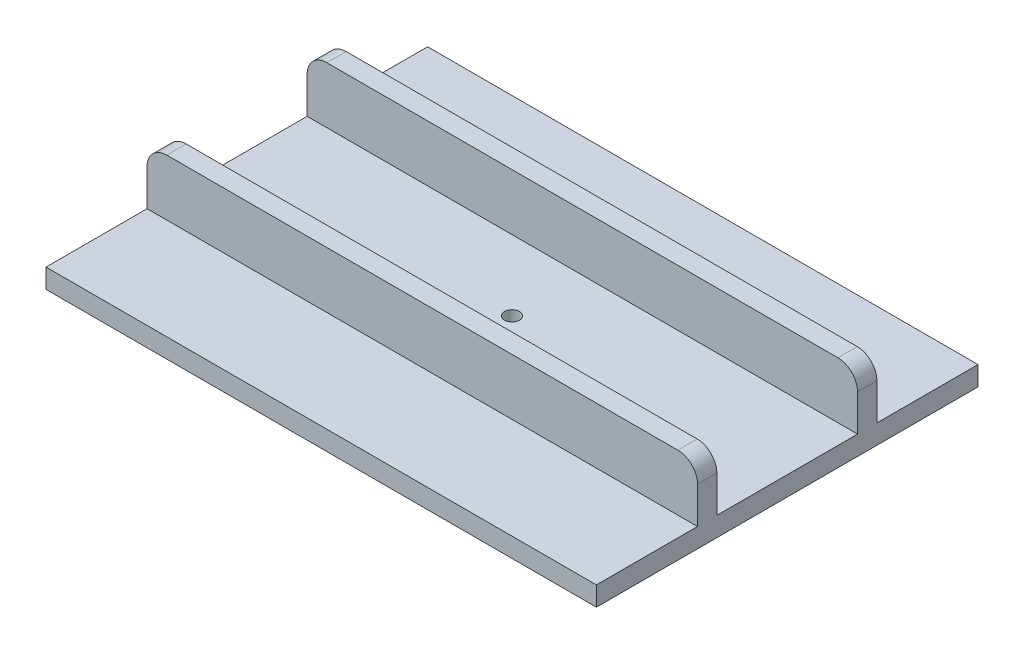
ISO-10303-21;
HEADER;
FILE_DESCRIPTION(('STEP AP214'),'2;1');
FILE_NAME('part.step','',(''),(''),'','','');
FILE_SCHEMA(('AUTOMOTIVE_DESIGN { 1 0 10303 214 1 1 1 1 }'));
ENDSEC;
DATA;
#1=APPLICATION_CONTEXT('core data for automotive mechanical design processes');
#2=APPLICATION_PROTOCOL_DEFINITION('international standard','automotive_design',2000,#1);
#3=PRODUCT_CONTEXT('',#1,'mechanical');
#4=PRODUCT('Part','Part','',(#3));
#5=PRODUCT_RELATED_PRODUCT_CATEGORY('part','',(#4));
#6=PRODUCT_DEFINITION_FORMATION('','',#4);
#7=PRODUCT_DEFINITION_CONTEXT('part definition',#1,'design');
#8=PRODUCT_DEFINITION('design','',#6,#7);
#9=PRODUCT_DEFINITION_SHAPE('','',#8);
#10=(LENGTH_UNIT() NAMED_UNIT(*) SI_UNIT(.MILLI.,.METRE.));
#11=(NAMED_UNIT(*) PLANE_ANGLE_UNIT() SI_UNIT($,.RADIAN.));
#12=(NAMED_UNIT(*) SI_UNIT($,.STERADIAN.) SOLID_ANGLE_UNIT());
#13=UNCERTAINTY_MEASURE_WITH_UNIT(LENGTH_MEASURE(1.E-05),#10,'distance_accuracy_value','');
#14=(GEOMETRIC_REPRESENTATION_CONTEXT(3) GLOBAL_UNCERTAINTY_ASSIGNED_CONTEXT((#13)) GLOBAL_UNIT_ASSIGNED_CONTEXT((#10,
#11,#12)) REPRESENTATION_CONTEXT('',''));
#15=CARTESIAN_POINT('',(0.,0.,0.));
#16=DIRECTION('',(0.,0.,1.));
#17=DIRECTION('',(1.,0.,0.));
#18=AXIS2_PLACEMENT_3D('',#15,#16,#17);
#19=CARTESIAN_POINT('',(0.,17.4625,0.));
#20=DIRECTION('',(0.,-1.,0.));
#21=DIRECTION('',(0.,0.,-1.));
#22=AXIS2_PLACEMENT_3D('',#19,#20,#21);
#23=PLANE('',#22);
#24=DIRECTION('',(0.,0.,-1.));
#25=VECTOR('',#24,1.);
#26=CARTESIAN_POINT('',(248.412,17.4625,172.212));
#27=LINE('',#26,#25);
#28=CARTESIAN_POINT('',(248.412,17.4625,172.212));
#29=VERTEX_POINT('',#28);
#30=CARTESIAN_POINT('',(248.412,17.4625,80.9625));
#31=VERTEX_POINT('',#30);
#32=EDGE_CURVE('E190',#29,#31,#27,.T.);
#33=ORIENTED_EDGE('',*,*,#32,.T.);
#34=DIRECTION('',(-1.,0.,0.));
#35=VECTOR('',#34,1.);
#36=CARTESIAN_POINT('',(-248.412,17.4625,80.9625));
#37=LINE('',#36,#35);
#38=CARTESIAN_POINT('',(-248.412,17.4625,80.9625));
#39=VERTEX_POINT('',#38);
#40=EDGE_CURVE('E169',#31,#39,#37,.T.);
#41=ORIENTED_EDGE('',*,*,#40,.T.);
#42=DIRECTION('',(0.,0.,1.));
#43=VECTOR('',#42,1.);
#44=CARTESIAN_POINT('',(-248.412,17.4625,172.212));
#45=LINE('',#44,#43);
#46=CARTESIAN_POINT('',(-248.412,17.4625,172.212));
#47=VERTEX_POINT('',#46);
#48=EDGE_CURVE('E178',#39,#47,#45,.T.);
#49=ORIENTED_EDGE('',*,*,#48,.T.);
#50=DIRECTION('',(1.,0.,0.));
#51=VECTOR('',#50,1.);
#52=CARTESIAN_POINT('',(-248.412,17.4625,172.212));
#53=LINE('',#52,#51);
#54=EDGE_CURVE('E236',#47,#29,#53,.T.);
#55=ORIENTED_EDGE('',*,*,#54,.T.);
#56=EDGE_LOOP('',(#33,#41,#49,#55));
#57=FACE_BOUND('',#56,.T.);
#58=ADVANCED_FACE('F49',(#57),#23,.F.);
#59=DIRECTION('',(-1.,0.,0.));
#60=VECTOR('',#59,1.);
#61=CARTESIAN_POINT('',(-248.412,17.4625,-80.9625));
#62=LINE('',#61,#60);
#63=CARTESIAN_POINT('',(248.412,17.4625,-80.9625));
#64=VERTEX_POINT('',#63);
#65=CARTESIAN_POINT('',(-248.412,17.4625,-80.9625));
#66=VERTEX_POINT('',#65);
#67=EDGE_CURVE('E209',#64,#66,#62,.T.);
#68=ORIENTED_EDGE('',*,*,#67,.F.);
#69=CARTESIAN_POINT('',(248.412,17.4625,-172.212));
#70=VERTEX_POINT('',#69);
#71=EDGE_CURVE('E233',#64,#70,#27,.T.);
#72=ORIENTED_EDGE('',*,*,#71,.T.);
#73=DIRECTION('',(-1.,0.,0.));
#74=VECTOR('',#73,1.);
#75=CARTESIAN_POINT('',(-248.412,17.4625,-172.212));
#76=LINE('',#75,#74);
#77=CARTESIAN_POINT('',(-248.412,17.4625,-172.212));
#78=VERTEX_POINT('',#77);
#79=EDGE_CURVE('E185',#70,#78,#76,.T.);
#80=ORIENTED_EDGE('',*,*,#79,.T.);
#81=EDGE_CURVE('E187',#78,#66,#45,.T.);
#82=ORIENTED_EDGE('',*,*,#81,.T.);
#83=EDGE_LOOP('',(#68,#72,#80,#82));
#84=FACE_BOUND('',#83,.T.);
#85=ADVANCED_FACE('F337',(#84),#23,.F.);
#86=CARTESIAN_POINT('',(0.,17.4625,0.));
#87=DIRECTION('',(0.,1.,0.));
#88=DIRECTION('',(0.,0.,1.));
#89=AXIS2_PLACEMENT_3D('',#86,#87,#88);
#90=CIRCLE('',#89,6.76275);
#91=CARTESIAN_POINT('',(0.,17.4625,6.76275));
#92=VERTEX_POINT('',#91);
#93=EDGE_CURVE('E225',#92,#92,#90,.T.);
#94=ORIENTED_EDGE('',*,*,#93,.F.);
#95=EDGE_LOOP('',(#94));
#96=FACE_BOUND('',#95,.T.);
#97=CARTESIAN_POINT('',(-248.412,17.4625,-63.5));
#98=VERTEX_POINT('',#97);
#99=CARTESIAN_POINT('',(-248.412,17.4625,63.5));
#100=VERTEX_POINT('',#99);
#101=EDGE_CURVE('E184',#98,#100,#45,.T.);
#102=ORIENTED_EDGE('',*,*,#101,.T.);
#103=DIRECTION('',(1.,0.,0.));
#104=VECTOR('',#103,1.);
#105=CARTESIAN_POINT('',(-248.412,17.4625,63.5));
#106=LINE('',#105,#104);
#107=CARTESIAN_POINT('',(248.412,17.4625,63.5));
#108=VERTEX_POINT('',#107);
#109=EDGE_CURVE('E191',#100,#108,#106,.T.);
#110=ORIENTED_EDGE('',*,*,#109,.T.);
#111=CARTESIAN_POINT('',(248.412,17.4625,-63.5));
#112=VERTEX_POINT('',#111);
#113=EDGE_CURVE('E232',#108,#112,#27,.T.);
#114=ORIENTED_EDGE('',*,*,#113,.T.);
#115=DIRECTION('',(1.,0.,0.));
#116=VECTOR('',#115,1.);
#117=CARTESIAN_POINT('',(-248.412,17.4625,-63.5));
#118=LINE('',#117,#116);
#119=EDGE_CURVE('E174',#98,#112,#118,.T.);
#120=ORIENTED_EDGE('',*,*,#119,.F.);
#121=EDGE_LOOP('',(#102,#110,#114,#120));
#122=FACE_BOUND('',#121,.T.);
#123=ADVANCED_FACE('F318',(#96,#122),#23,.F.);
#124=CARTESIAN_POINT('',(248.412,17.4625,172.212));
#125=DIRECTION('',(-1.,0.,0.));
#126=DIRECTION('',(0.,0.,1.));
#127=AXIS2_PLACEMENT_3D('',#124,#125,#126);
#128=PLANE('',#127);
#129=DIRECTION('',(0.,-1.,0.));
#130=VECTOR('',#129,1.);
#131=CARTESIAN_POINT('',(248.412,68.2625,-80.9625));
#132=LINE('',#131,#130);
#133=CARTESIAN_POINT('',(248.412,50.4825,-80.9625));
#134=VERTEX_POINT('',#133);
#135=EDGE_CURVE('E218',#134,#64,#132,.T.);
#136=ORIENTED_EDGE('',*,*,#135,.F.);
#137=DIRECTION('',(0.,0.,-1.));
#138=VECTOR('',#137,1.);
#139=CARTESIAN_POINT('',(248.412,50.4825,-63.5));
#140=LINE('',#139,#138);
#141=CARTESIAN_POINT('',(248.412,50.4825,-63.5));
#142=VERTEX_POINT('',#141);
#143=EDGE_CURVE('E269',#134,#142,#140,.F.);
#144=ORIENTED_EDGE('',*,*,#143,.T.);
#145=DIRECTION('',(0.,-1.,0.));
#146=VECTOR('',#145,1.);
#147=CARTESIAN_POINT('',(248.412,68.2625,-63.5));
#148=LINE('',#147,#146);
#149=EDGE_CURVE('E220',#142,#112,#148,.T.);
#150=ORIENTED_EDGE('',*,*,#149,.T.);
#151=ORIENTED_EDGE('',*,*,#113,.F.);
#152=DIRECTION('',(0.,-1.,0.));
#153=VECTOR('',#152,1.);
#154=CARTESIAN_POINT('',(248.412,68.2625,63.5));
#155=LINE('',#154,#153);
#156=CARTESIAN_POINT('',(248.412,50.4825,63.5));
#157=VERTEX_POINT('',#156);
#158=EDGE_CURVE('E202',#157,#108,#155,.T.);
#159=ORIENTED_EDGE('',*,*,#158,.F.);
#160=DIRECTION('',(0.,0.,1.));
#161=VECTOR('',#160,1.);
#162=CARTESIAN_POINT('',(248.412,50.4825,80.9625));
#163=LINE('',#162,#161);
#164=CARTESIAN_POINT('',(248.412,50.4825,80.9625));
#165=VERTEX_POINT('',#164);
#166=EDGE_CURVE('E266',#157,#165,#163,.T.);
#167=ORIENTED_EDGE('',*,*,#166,.T.);
#168=DIRECTION('',(0.,-1.,0.));
#169=VECTOR('',#168,1.);
#170=CARTESIAN_POINT('',(248.412,68.2625,80.9625));
#171=LINE('',#170,#169);
#172=EDGE_CURVE('E175',#165,#31,#171,.T.);
#173=ORIENTED_EDGE('',*,*,#172,.T.);
#174=ORIENTED_EDGE('',*,*,#32,.F.);
#175=DIRECTION('',(0.,-1.,0.));
#176=VECTOR('',#175,1.);
#177=CARTESIAN_POINT('',(248.412,17.4625,172.212));
#178=LINE('',#177,#176);
#179=CARTESIAN_POINT('',(248.412,0.,172.212));
#180=VERTEX_POINT('',#179);
#181=EDGE_CURVE('E238',#29,#180,#178,.T.);
#182=ORIENTED_EDGE('',*,*,#181,.T.);
#183=DIRECTION('',(0.,0.,-1.));
#184=VECTOR('',#183,1.);
#185=CARTESIAN_POINT('',(248.412,0.,172.212));
#186=LINE('',#185,#184);
#187=CARTESIAN_POINT('',(248.412,0.,-172.212));
#188=VERTEX_POINT('',#187);
#189=EDGE_CURVE('E228',#180,#188,#186,.T.);
#190=ORIENTED_EDGE('',*,*,#189,.T.);
#191=DIRECTION('',(0.,-1.,0.));
#192=VECTOR('',#191,1.);
#193=CARTESIAN_POINT('',(248.412,17.4625,-172.212));
#194=LINE('',#193,#192);
#195=EDGE_CURVE('E253',#70,#188,#194,.T.);
#196=ORIENTED_EDGE('',*,*,#195,.F.);
#197=ORIENTED_EDGE('',*,*,#71,.F.);
#198=EDGE_LOOP('',(#136,#144,#150,#151,#159,#167,#173,#174,#182,#190,#196,#197));
#199=FACE_BOUND('',#198,.T.);
#200=ADVANCED_FACE('F309',(#199),#128,.F.);
#201=CARTESIAN_POINT('',(-248.412,17.4625,-172.212));
#202=DIRECTION('',(0.,0.,1.));
#203=DIRECTION('',(1.,0.,0.));
#204=AXIS2_PLACEMENT_3D('',#201,#202,#203);
#205=PLANE('',#204);
#206=DIRECTION('',(-1.,0.,0.));
#207=VECTOR('',#206,1.);
#208=CARTESIAN_POINT('',(-248.412,0.,-172.212));
#209=LINE('',#208,#207);
#210=CARTESIAN_POINT('',(-248.412,0.,-172.212));
#211=VERTEX_POINT('',#210);
#212=EDGE_CURVE('E241',#188,#211,#209,.T.);
#213=ORIENTED_EDGE('',*,*,#212,.T.);
#214=DIRECTION('',(0.,-1.,0.));
#215=VECTOR('',#214,1.);
#216=CARTESIAN_POINT('',(-248.412,17.4625,-172.212));
#217=LINE('',#216,#215);
#218=EDGE_CURVE('E250',#78,#211,#217,.T.);
#219=ORIENTED_EDGE('',*,*,#218,.F.);
#220=ORIENTED_EDGE('',*,*,#79,.F.);
#221=ORIENTED_EDGE('',*,*,#195,.T.);
#222=EDGE_LOOP('',(#213,#219,#220,#221));
#223=FACE_BOUND('',#222,.T.);
#224=ADVANCED_FACE('F349',(#223),#205,.F.);
#225=CARTESIAN_POINT('',(-248.412,17.4625,172.212));
#226=DIRECTION('',(1.,0.,0.));
#227=DIRECTION('',(0.,0.,-1.));
#228=AXIS2_PLACEMENT_3D('',#225,#226,#227);
#229=PLANE('',#228);
#230=DIRECTION('',(0.,-1.,0.));
#231=VECTOR('',#230,1.);
#232=CARTESIAN_POINT('',(-248.412,68.2625,80.9625));
#233=LINE('',#232,#231);
#234=CARTESIAN_POINT('',(-248.412,50.4825,80.9625));
#235=VERTEX_POINT('',#234);
#236=EDGE_CURVE('E164',#235,#39,#233,.T.);
#237=ORIENTED_EDGE('',*,*,#236,.F.);
#238=DIRECTION('',(0.,0.,-1.));
#239=VECTOR('',#238,1.);
#240=CARTESIAN_POINT('',(-248.412,50.4825,63.5));
#241=LINE('',#240,#239);
#242=CARTESIAN_POINT('',(-248.412,50.4825,63.5));
#243=VERTEX_POINT('',#242);
#244=EDGE_CURVE('E11',#235,#243,#241,.T.);
#245=ORIENTED_EDGE('',*,*,#244,.T.);
#246=DIRECTION('',(0.,-1.,0.));
#247=VECTOR('',#246,1.);
#248=CARTESIAN_POINT('',(-248.412,68.2625,63.5));
#249=LINE('',#248,#247);
#250=EDGE_CURVE('E200',#243,#100,#249,.T.);
#251=ORIENTED_EDGE('',*,*,#250,.T.);
#252=ORIENTED_EDGE('',*,*,#101,.F.);
#253=DIRECTION('',(0.,-1.,0.));
#254=VECTOR('',#253,1.);
#255=CARTESIAN_POINT('',(-248.412,68.2625,-63.5));
#256=LINE('',#255,#254);
#257=CARTESIAN_POINT('',(-248.412,50.4825,-63.5));
#258=VERTEX_POINT('',#257);
#259=EDGE_CURVE('E222',#258,#98,#256,.T.);
#260=ORIENTED_EDGE('',*,*,#259,.F.);
#261=DIRECTION('',(0.,0.,1.));
#262=VECTOR('',#261,1.);
#263=CARTESIAN_POINT('',(-248.412,50.4825,-80.9625));
#264=LINE('',#263,#262);
#265=CARTESIAN_POINT('',(-248.412,50.4825,-80.9625));
#266=VERTEX_POINT('',#265);
#267=EDGE_CURVE('E57',#258,#266,#264,.F.);
#268=ORIENTED_EDGE('',*,*,#267,.T.);
#269=DIRECTION('',(0.,-1.,0.));
#270=VECTOR('',#269,1.);
#271=CARTESIAN_POINT('',(-248.412,68.2625,-80.9625));
#272=LINE('',#271,#270);
#273=EDGE_CURVE('E212',#266,#66,#272,.T.);
#274=ORIENTED_EDGE('',*,*,#273,.T.);
#275=ORIENTED_EDGE('',*,*,#81,.F.);
#276=ORIENTED_EDGE('',*,*,#218,.T.);
#277=DIRECTION('',(0.,0.,1.));
#278=VECTOR('',#277,1.);
#279=CARTESIAN_POINT('',(-248.412,0.,172.212));
#280=LINE('',#279,#278);
#281=CARTESIAN_POINT('',(-248.412,0.,172.212));
#282=VERTEX_POINT('',#281);
#283=EDGE_CURVE('E243',#211,#282,#280,.T.);
#284=ORIENTED_EDGE('',*,*,#283,.T.);
#285=DIRECTION('',(0.,-1.,0.));
#286=VECTOR('',#285,1.);
#287=CARTESIAN_POINT('',(-248.412,17.4625,172.212));
#288=LINE('',#287,#286);
#289=EDGE_CURVE('E181',#47,#282,#288,.T.);
#290=ORIENTED_EDGE('',*,*,#289,.F.);
#291=ORIENTED_EDGE('',*,*,#48,.F.);
#292=EDGE_LOOP('',(#237,#245,#251,#252,#260,#268,#274,#275,#276,#284,#290,#291));
#293=FACE_BOUND('',#292,.T.);
#294=ADVANCED_FACE('F179',(#293),#229,.F.);
#295=CARTESIAN_POINT('',(-248.412,17.4625,172.212));
#296=DIRECTION('',(0.,0.,-1.));
#297=DIRECTION('',(-1.,0.,0.));
#298=AXIS2_PLACEMENT_3D('',#295,#296,#297);
#299=PLANE('',#298);
#300=DIRECTION('',(1.,0.,0.));
#301=VECTOR('',#300,1.);
#302=CARTESIAN_POINT('',(-248.412,0.,172.212));
#303=LINE('',#302,#301);
#304=EDGE_CURVE('E245',#282,#180,#303,.T.);
#305=ORIENTED_EDGE('',*,*,#304,.T.);
#306=ORIENTED_EDGE('',*,*,#181,.F.);
#307=ORIENTED_EDGE('',*,*,#54,.F.);
#308=ORIENTED_EDGE('',*,*,#289,.T.);
#309=EDGE_LOOP('',(#305,#306,#307,#308));
#310=FACE_BOUND('',#309,.T.);
#311=ADVANCED_FACE('F362',(#310),#299,.F.);
#312=CARTESIAN_POINT('',(0.,0.,0.));
#313=DIRECTION('',(0.,-1.,0.));
#314=DIRECTION('',(0.,0.,-1.));
#315=AXIS2_PLACEMENT_3D('',#312,#313,#314);
#316=PLANE('',#315);
#317=CARTESIAN_POINT('',(0.,0.,0.));
#318=DIRECTION('',(0.,-1.,0.));
#319=DIRECTION('',(0.,0.,-1.));
#320=AXIS2_PLACEMENT_3D('',#317,#318,#319);
#321=CIRCLE('',#320,6.76275);
#322=CARTESIAN_POINT('',(0.,0.,-6.76275));
#323=VERTEX_POINT('',#322);
#324=EDGE_CURVE('E224',#323,#323,#321,.F.);
#325=ORIENTED_EDGE('',*,*,#324,.T.);
#326=EDGE_LOOP('',(#325));
#327=FACE_BOUND('',#326,.T.);
#328=ORIENTED_EDGE('',*,*,#189,.F.);
#329=ORIENTED_EDGE('',*,*,#304,.F.);
#330=ORIENTED_EDGE('',*,*,#283,.F.);
#331=ORIENTED_EDGE('',*,*,#212,.F.);
#332=EDGE_LOOP('',(#328,#329,#330,#331));
#333=FACE_BOUND('',#332,.T.);
#334=ADVANCED_FACE('F355',(#327,#333),#316,.T.);
#335=CARTESIAN_POINT('',(0.,-0.001000000000001,0.));
#336=DIRECTION('',(0.,1.,0.));
#337=DIRECTION('',(0.,0.,1.));
#338=AXIS2_PLACEMENT_3D('',#335,#336,#337);
#339=CYLINDRICAL_SURFACE('',#338,6.76275);
#340=ORIENTED_EDGE('',*,*,#324,.F.);
#341=EDGE_LOOP('',(#340));
#342=FACE_BOUND('',#341,.T.);
#343=ORIENTED_EDGE('',*,*,#93,.T.);
#344=EDGE_LOOP('',(#343));
#345=FACE_BOUND('',#344,.T.);
#346=ADVANCED_FACE('F353',(#342,#345),#339,.F.);
#347=CARTESIAN_POINT('',(-248.412,68.2625,-63.5));
#348=DIRECTION('',(0.,0.,-1.));
#349=DIRECTION('',(-1.,0.,0.));
#350=AXIS2_PLACEMENT_3D('',#347,#348,#349);
#351=PLANE('',#350);
#352=ORIENTED_EDGE('',*,*,#149,.F.);
#353=CARTESIAN_POINT('',(230.632,50.4825,-63.5));
#354=DIRECTION('',(0.,0.,-1.));
#355=DIRECTION('',(-1.,0.,0.));
#356=AXIS2_PLACEMENT_3D('',#353,#354,#355);
#357=CIRCLE('',#356,17.78);
#358=CARTESIAN_POINT('',(230.632,68.2625,-63.5));
#359=VERTEX_POINT('',#358);
#360=EDGE_CURVE('E273',#142,#359,#357,.F.);
#361=ORIENTED_EDGE('',*,*,#360,.T.);
#362=DIRECTION('',(1.,0.,0.));
#363=VECTOR('',#362,1.);
#364=CARTESIAN_POINT('',(-248.412,68.2625,-63.5));
#365=LINE('',#364,#363);
#366=CARTESIAN_POINT('',(-230.632,68.2625,-63.5));
#367=VERTEX_POINT('',#366);
#368=EDGE_CURVE('E205',#367,#359,#365,.T.);
#369=ORIENTED_EDGE('',*,*,#368,.F.);
#370=CARTESIAN_POINT('',(-230.632,50.4825,-63.5));
#371=DIRECTION('',(0.,0.,-1.));
#372=DIRECTION('',(-1.,0.,0.));
#373=AXIS2_PLACEMENT_3D('',#370,#371,#372);
#374=CIRCLE('',#373,17.78);
#375=EDGE_CURVE('E271',#367,#258,#374,.F.);
#376=ORIENTED_EDGE('',*,*,#375,.T.);
#377=ORIENTED_EDGE('',*,*,#259,.T.);
#378=ORIENTED_EDGE('',*,*,#119,.T.);
#379=EDGE_LOOP('',(#352,#361,#369,#376,#377,#378));
#380=FACE_BOUND('',#379,.T.);
#381=ADVANCED_FACE('F301',(#380),#351,.F.);
#382=CARTESIAN_POINT('',(-248.412,68.2625,-80.9625));
#383=DIRECTION('',(0.,0.,1.));
#384=DIRECTION('',(1.,0.,0.));
#385=AXIS2_PLACEMENT_3D('',#382,#383,#384);
#386=PLANE('',#385);
#387=DIRECTION('',(-1.,0.,0.));
#388=VECTOR('',#387,1.);
#389=CARTESIAN_POINT('',(-248.412,68.2625,-80.9625));
#390=LINE('',#389,#388);
#391=CARTESIAN_POINT('',(230.632,68.2625,-80.9625));
#392=VERTEX_POINT('',#391);
#393=CARTESIAN_POINT('',(-230.632,68.2625,-80.9625));
#394=VERTEX_POINT('',#393);
#395=EDGE_CURVE('E208',#392,#394,#390,.T.);
#396=ORIENTED_EDGE('',*,*,#395,.F.);
#397=CARTESIAN_POINT('',(230.632,50.4825,-80.9625));
#398=DIRECTION('',(0.,0.,1.));
#399=DIRECTION('',(1.,0.,0.));
#400=AXIS2_PLACEMENT_3D('',#397,#398,#399);
#401=CIRCLE('',#400,17.78);
#402=EDGE_CURVE('E264',#392,#134,#401,.F.);
#403=ORIENTED_EDGE('',*,*,#402,.T.);
#404=ORIENTED_EDGE('',*,*,#135,.T.);
#405=ORIENTED_EDGE('',*,*,#67,.T.);
#406=ORIENTED_EDGE('',*,*,#273,.F.);
#407=CARTESIAN_POINT('',(-230.632,50.4825,-80.9625));
#408=DIRECTION('',(0.,0.,1.));
#409=DIRECTION('',(1.,0.,0.));
#410=AXIS2_PLACEMENT_3D('',#407,#408,#409);
#411=CIRCLE('',#410,17.78);
#412=EDGE_CURVE('E262',#266,#394,#411,.F.);
#413=ORIENTED_EDGE('',*,*,#412,.T.);
#414=EDGE_LOOP('',(#396,#403,#404,#405,#406,#413));
#415=FACE_BOUND('',#414,.T.);
#416=ADVANCED_FACE('F292',(#415),#386,.F.);
#417=CARTESIAN_POINT('',(0.,68.2625,0.));
#418=DIRECTION('',(0.,1.,0.));
#419=DIRECTION('',(0.,0.,1.));
#420=AXIS2_PLACEMENT_3D('',#417,#418,#419);
#421=PLANE('',#420);
#422=ORIENTED_EDGE('',*,*,#368,.T.);
#423=DIRECTION('',(0.,0.,-1.));
#424=VECTOR('',#423,1.);
#425=CARTESIAN_POINT('',(230.632,68.2625,-80.9625));
#426=LINE('',#425,#424);
#427=EDGE_CURVE('E259',#359,#392,#426,.T.);
#428=ORIENTED_EDGE('',*,*,#427,.T.);
#429=ORIENTED_EDGE('',*,*,#395,.T.);
#430=DIRECTION('',(0.,0.,1.));
#431=VECTOR('',#430,1.);
#432=CARTESIAN_POINT('',(-230.632,68.2625,-63.5));
#433=LINE('',#432,#431);
#434=EDGE_CURVE('E256',#394,#367,#433,.T.);
#435=ORIENTED_EDGE('',*,*,#434,.T.);
#436=EDGE_LOOP('',(#422,#428,#429,#435));
#437=FACE_BOUND('',#436,.T.);
#438=ADVANCED_FACE('F297',(#437),#421,.T.);
#439=CARTESIAN_POINT('',(-248.412,68.2625,80.9625));
#440=DIRECTION('',(0.,0.,1.));
#441=DIRECTION('',(1.,0.,0.));
#442=AXIS2_PLACEMENT_3D('',#439,#440,#441);
#443=PLANE('',#442);
#444=ORIENTED_EDGE('',*,*,#172,.F.);
#445=CARTESIAN_POINT('',(230.632,50.4825,80.9625));
#446=DIRECTION('',(0.,0.,1.));
#447=DIRECTION('',(1.,0.,0.));
#448=AXIS2_PLACEMENT_3D('',#445,#446,#447);
#449=CIRCLE('',#448,17.78);
#450=CARTESIAN_POINT('',(230.632,68.2625,80.9625));
#451=VERTEX_POINT('',#450);
#452=EDGE_CURVE('E276',#165,#451,#449,.T.);
#453=ORIENTED_EDGE('',*,*,#452,.T.);
#454=DIRECTION('',(-1.,0.,0.));
#455=VECTOR('',#454,1.);
#456=CARTESIAN_POINT('',(-248.412,68.2625,80.9625));
#457=LINE('',#456,#455);
#458=CARTESIAN_POINT('',(-230.632,68.2625,80.9625));
#459=VERTEX_POINT('',#458);
#460=EDGE_CURVE('E194',#451,#459,#457,.T.);
#461=ORIENTED_EDGE('',*,*,#460,.T.);
#462=CARTESIAN_POINT('',(-230.632,50.4825,80.9625));
#463=DIRECTION('',(0.,0.,1.));
#464=DIRECTION('',(1.,0.,0.));
#465=AXIS2_PLACEMENT_3D('',#462,#463,#464);
#466=CIRCLE('',#465,17.78);
#467=EDGE_CURVE('E172',#459,#235,#466,.T.);
#468=ORIENTED_EDGE('',*,*,#467,.T.);
#469=ORIENTED_EDGE('',*,*,#236,.T.);
#470=ORIENTED_EDGE('',*,*,#40,.F.);
#471=EDGE_LOOP('',(#444,#453,#461,#468,#469,#470));
#472=FACE_BOUND('',#471,.T.);
#473=ADVANCED_FACE('F167',(#472),#443,.T.);
#474=CARTESIAN_POINT('',(-248.412,68.2625,63.5));
#475=DIRECTION('',(0.,0.,-1.));
#476=DIRECTION('',(-1.,0.,0.));
#477=AXIS2_PLACEMENT_3D('',#474,#475,#476);
#478=PLANE('',#477);
#479=DIRECTION('',(1.,0.,0.));
#480=VECTOR('',#479,1.);
#481=CARTESIAN_POINT('',(-248.412,68.2625,63.5));
#482=LINE('',#481,#480);
#483=CARTESIAN_POINT('',(-230.632,68.2625,63.5));
#484=VERTEX_POINT('',#483);
#485=CARTESIAN_POINT('',(230.632,68.2625,63.5));
#486=VERTEX_POINT('',#485);
#487=EDGE_CURVE('E197',#484,#486,#482,.T.);
#488=ORIENTED_EDGE('',*,*,#487,.T.);
#489=CARTESIAN_POINT('',(230.632,50.4825,63.5));
#490=DIRECTION('',(0.,0.,-1.));
#491=DIRECTION('',(-1.,0.,0.));
#492=AXIS2_PLACEMENT_3D('',#489,#490,#491);
#493=CIRCLE('',#492,17.78);
#494=EDGE_CURVE('E282',#486,#157,#493,.T.);
#495=ORIENTED_EDGE('',*,*,#494,.T.);
#496=ORIENTED_EDGE('',*,*,#158,.T.);
#497=ORIENTED_EDGE('',*,*,#109,.F.);
#498=ORIENTED_EDGE('',*,*,#250,.F.);
#499=CARTESIAN_POINT('',(-230.632,50.4825,63.5));
#500=DIRECTION('',(0.,0.,-1.));
#501=DIRECTION('',(-1.,0.,0.));
#502=AXIS2_PLACEMENT_3D('',#499,#500,#501);
#503=CIRCLE('',#502,17.78);
#504=EDGE_CURVE('E64',#243,#484,#503,.T.);
#505=ORIENTED_EDGE('',*,*,#504,.T.);
#506=EDGE_LOOP('',(#488,#495,#496,#497,#498,#505));
#507=FACE_BOUND('',#506,.T.);
#508=ADVANCED_FACE('F327',(#507),#478,.T.);
#509=CARTESIAN_POINT('',(0.,68.2625,0.));
#510=DIRECTION('',(0.,1.,0.));
#511=DIRECTION('',(0.,0.,-1.));
#512=AXIS2_PLACEMENT_3D('',#509,#510,#511);
#513=PLANE('',#512);
#514=ORIENTED_EDGE('',*,*,#460,.F.);
#515=DIRECTION('',(0.,0.,1.));
#516=VECTOR('',#515,1.);
#517=CARTESIAN_POINT('',(230.632,68.2625,63.5));
#518=LINE('',#517,#516);
#519=EDGE_CURVE('E71',#451,#486,#518,.F.);
#520=ORIENTED_EDGE('',*,*,#519,.T.);
#521=ORIENTED_EDGE('',*,*,#487,.F.);
#522=DIRECTION('',(0.,0.,-1.));
#523=VECTOR('',#522,1.);
#524=CARTESIAN_POINT('',(-230.632,68.2625,80.9625));
#525=LINE('',#524,#523);
#526=EDGE_CURVE('E278',#484,#459,#525,.F.);
#527=ORIENTED_EDGE('',*,*,#526,.T.);
#528=EDGE_LOOP('',(#514,#520,#521,#527));
#529=FACE_BOUND('',#528,.T.);
#530=ADVANCED_FACE('F326',(#529),#513,.T.);
#531=CARTESIAN_POINT('',(230.632,50.4825,0.));
#532=DIRECTION('',(0.,0.,1.));
#533=DIRECTION('',(1.,0.,0.));
#534=AXIS2_PLACEMENT_3D('',#531,#532,#533);
#535=CYLINDRICAL_SURFACE('',#534,17.78);
#536=ORIENTED_EDGE('',*,*,#360,.F.);
#537=ORIENTED_EDGE('',*,*,#143,.F.);
#538=ORIENTED_EDGE('',*,*,#402,.F.);
#539=ORIENTED_EDGE('',*,*,#427,.F.);
#540=EDGE_LOOP('',(#536,#537,#538,#539));
#541=FACE_BOUND('',#540,.T.);
#542=ADVANCED_FACE('F305',(#541),#535,.T.);
#543=CARTESIAN_POINT('',(230.632,50.4825,172.212));
#544=DIRECTION('',(0.,0.,-1.));
#545=DIRECTION('',(-1.,0.,0.));
#546=AXIS2_PLACEMENT_3D('',#543,#544,#545);
#547=CYLINDRICAL_SURFACE('',#546,17.78);
#548=ORIENTED_EDGE('',*,*,#494,.F.);
#549=ORIENTED_EDGE('',*,*,#519,.F.);
#550=ORIENTED_EDGE('',*,*,#452,.F.);
#551=ORIENTED_EDGE('',*,*,#166,.F.);
#552=EDGE_LOOP('',(#548,#549,#550,#551));
#553=FACE_BOUND('',#552,.T.);
#554=ADVANCED_FACE('F325',(#553),#547,.T.);
#555=CARTESIAN_POINT('',(-230.632,50.4825,172.212));
#556=DIRECTION('',(0.,0.,1.));
#557=DIRECTION('',(1.,0.,0.));
#558=AXIS2_PLACEMENT_3D('',#555,#556,#557);
#559=CYLINDRICAL_SURFACE('',#558,17.78);
#560=ORIENTED_EDGE('',*,*,#467,.F.);
#561=ORIENTED_EDGE('',*,*,#526,.F.);
#562=ORIENTED_EDGE('',*,*,#504,.F.);
#563=ORIENTED_EDGE('',*,*,#244,.F.);
#564=EDGE_LOOP('',(#560,#561,#562,#563));
#565=FACE_BOUND('',#564,.T.);
#566=ADVANCED_FACE('F329',(#565),#559,.T.);
#567=CARTESIAN_POINT('',(-230.632,50.4825,0.));
#568=DIRECTION('',(0.,0.,-1.));
#569=DIRECTION('',(-1.,0.,0.));
#570=AXIS2_PLACEMENT_3D('',#567,#568,#569);
#571=CYLINDRICAL_SURFACE('',#570,17.78);
#572=ORIENTED_EDGE('',*,*,#412,.F.);
#573=ORIENTED_EDGE('',*,*,#267,.F.);
#574=ORIENTED_EDGE('',*,*,#375,.F.);
#575=ORIENTED_EDGE('',*,*,#434,.F.);
#576=EDGE_LOOP('',(#572,#573,#574,#575));
#577=FACE_BOUND('',#576,.T.);
#578=ADVANCED_FACE('F51',(#577),#571,.T.);
#579=CLOSED_SHELL('',(#58,#85,#123,#200,#224,#294,#311,#334,#346,#381,#416,#438,#473,#508,#530,
#542,#554,#566,#578));
#580=MANIFOLD_SOLID_BREP('B2',#579);
#581=ADVANCED_BREP_SHAPE_REPRESENTATION('',(#18,#580),#14);
#582=SHAPE_DEFINITION_REPRESENTATION(#9,#581);
ENDSEC;
END-ISO-10303-21;
